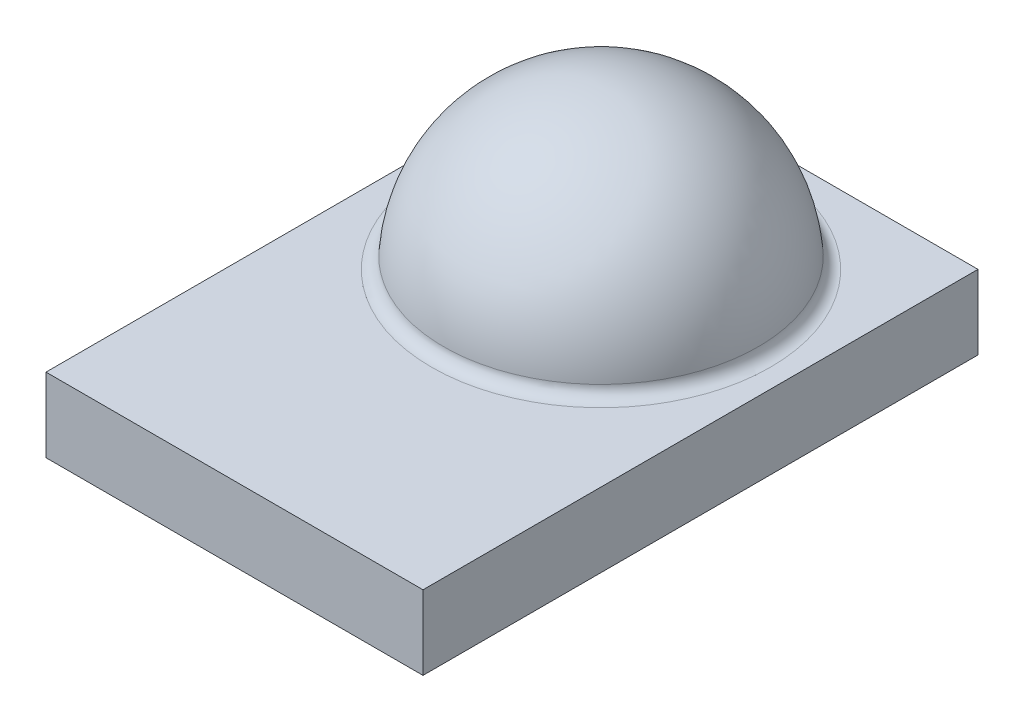
ISO-10303-21;
HEADER;
FILE_DESCRIPTION(('STEP AP214'),'2;1');
FILE_NAME('part.step','',(''),(''),'','','');
FILE_SCHEMA(('AUTOMOTIVE_DESIGN { 1 0 10303 214 1 1 1 1 }'));
ENDSEC;
DATA;
#1=APPLICATION_CONTEXT('core data for automotive mechanical design processes');
#2=APPLICATION_PROTOCOL_DEFINITION('international standard','automotive_design',2000,#1);
#3=PRODUCT_CONTEXT('',#1,'mechanical');
#4=PRODUCT('Part','Part','',(#3));
#5=PRODUCT_RELATED_PRODUCT_CATEGORY('part','',(#4));
#6=PRODUCT_DEFINITION_FORMATION('','',#4);
#7=PRODUCT_DEFINITION_CONTEXT('part definition',#1,'design');
#8=PRODUCT_DEFINITION('design','',#6,#7);
#9=PRODUCT_DEFINITION_SHAPE('','',#8);
#10=(LENGTH_UNIT() NAMED_UNIT(*) SI_UNIT(.MILLI.,.METRE.));
#11=(NAMED_UNIT(*) PLANE_ANGLE_UNIT() SI_UNIT($,.RADIAN.));
#12=(NAMED_UNIT(*) SI_UNIT($,.STERADIAN.) SOLID_ANGLE_UNIT());
#13=UNCERTAINTY_MEASURE_WITH_UNIT(LENGTH_MEASURE(1.E-05),#10,'distance_accuracy_value','');
#14=(GEOMETRIC_REPRESENTATION_CONTEXT(3) GLOBAL_UNCERTAINTY_ASSIGNED_CONTEXT((#13)) GLOBAL_UNIT_ASSIGNED_CONTEXT((#10,
#11,#12)) REPRESENTATION_CONTEXT('',''));
#15=CARTESIAN_POINT('',(0.,0.,0.));
#16=DIRECTION('',(0.,0.,1.));
#17=DIRECTION('',(1.,0.,0.));
#18=AXIS2_PLACEMENT_3D('',#15,#16,#17);
#19=CARTESIAN_POINT('',(0.,0.,0.));
#20=DIRECTION('',(0.,-1.,0.));
#21=DIRECTION('',(0.,0.,-1.));
#22=AXIS2_PLACEMENT_3D('',#19,#20,#21);
#23=PLANE('',#22);
#24=DIRECTION('',(0.,0.,1.));
#25=VECTOR('',#24,1.);
#26=CARTESIAN_POINT('',(0.,0.,0.));
#27=LINE('',#26,#25);
#28=CARTESIAN_POINT('',(0.,0.,-4.48999999999999));
#29=VERTEX_POINT('',#28);
#30=CARTESIAN_POINT('',(0.,0.,0.));
#31=VERTEX_POINT('',#30);
#32=EDGE_CURVE('E233',#29,#31,#27,.T.);
#33=ORIENTED_EDGE('',*,*,#32,.F.);
#34=DIRECTION('',(-1.,0.,0.));
#35=VECTOR('',#34,1.);
#36=CARTESIAN_POINT('',(0.,0.,-4.48999999999999));
#37=LINE('',#36,#35);
#38=CARTESIAN_POINT('',(3.05,0.,-4.48999999999999));
#39=VERTEX_POINT('',#38);
#40=EDGE_CURVE('E238',#39,#29,#37,.T.);
#41=ORIENTED_EDGE('',*,*,#40,.F.);
#42=DIRECTION('',(0.,0.,-1.));
#43=VECTOR('',#42,1.);
#44=CARTESIAN_POINT('',(3.05,0.,0.));
#45=LINE('',#44,#43);
#46=CARTESIAN_POINT('',(3.05,0.,0.));
#47=VERTEX_POINT('',#46);
#48=EDGE_CURVE('E249',#47,#39,#45,.T.);
#49=ORIENTED_EDGE('',*,*,#48,.F.);
#50=DIRECTION('',(1.,0.,0.));
#51=VECTOR('',#50,1.);
#52=CARTESIAN_POINT('',(0.,0.,0.));
#53=LINE('',#52,#51);
#54=EDGE_CURVE('E247',#31,#47,#53,.T.);
#55=ORIENTED_EDGE('',*,*,#54,.F.);
#56=EDGE_LOOP('',(#33,#41,#49,#55));
#57=FACE_BOUND('',#56,.T.);
#58=DIRECTION('',(1.,0.,0.));
#59=VECTOR('',#58,1.);
#60=CARTESIAN_POINT('',(0.124999999999997,0.,-4.36499999999999));
#61=LINE('',#60,#59);
#62=CARTESIAN_POINT('',(0.124999999999997,0.,-4.36499999999999));
#63=VERTEX_POINT('',#62);
#64=CARTESIAN_POINT('',(2.925,0.,-4.36499999999999));
#65=VERTEX_POINT('',#64);
#66=EDGE_CURVE('E218',#63,#65,#61,.T.);
#67=ORIENTED_EDGE('',*,*,#66,.F.);
#68=DIRECTION('',(0.,0.,-1.));
#69=VECTOR('',#68,1.);
#70=CARTESIAN_POINT('',(0.124999999999997,0.,-4.36499999999999));
#71=LINE('',#70,#69);
#72=CARTESIAN_POINT('',(0.124999999999997,0.,-2.59499999999999));
#73=VERTEX_POINT('',#72);
#74=EDGE_CURVE('E204',#73,#63,#71,.T.);
#75=ORIENTED_EDGE('',*,*,#74,.F.);
#76=DIRECTION('',(-1.,0.,0.));
#77=VECTOR('',#76,1.);
#78=CARTESIAN_POINT('',(0.124999999999997,0.,-2.59499999999999));
#79=LINE('',#78,#77);
#80=CARTESIAN_POINT('',(2.925,0.,-2.59499999999999));
#81=VERTEX_POINT('',#80);
#82=EDGE_CURVE('E209',#81,#73,#79,.T.);
#83=ORIENTED_EDGE('',*,*,#82,.F.);
#84=DIRECTION('',(0.,0.,1.));
#85=VECTOR('',#84,1.);
#86=CARTESIAN_POINT('',(2.925,0.,-4.36499999999999));
#87=LINE('',#86,#85);
#88=EDGE_CURVE('E220',#65,#81,#87,.T.);
#89=ORIENTED_EDGE('',*,*,#88,.F.);
#90=EDGE_LOOP('',(#67,#75,#83,#89));
#91=FACE_BOUND('',#90,.T.);
#92=DIRECTION('',(1.,0.,0.));
#93=VECTOR('',#92,1.);
#94=CARTESIAN_POINT('',(0.124999999999997,0.,-0.794999999999994));
#95=LINE('',#94,#93);
#96=CARTESIAN_POINT('',(0.124999999999997,0.,-0.794999999999994));
#97=VERTEX_POINT('',#96);
#98=CARTESIAN_POINT('',(1.325,0.,-0.794999999999994));
#99=VERTEX_POINT('',#98);
#100=EDGE_CURVE('E176',#97,#99,#95,.T.);
#101=ORIENTED_EDGE('',*,*,#100,.F.);
#102=DIRECTION('',(0.,0.,-1.));
#103=VECTOR('',#102,1.);
#104=CARTESIAN_POINT('',(0.124999999999997,0.,-0.124999999999994));
#105=LINE('',#104,#103);
#106=CARTESIAN_POINT('',(0.124999999999997,0.,-0.124999999999994));
#107=VERTEX_POINT('',#106);
#108=EDGE_CURVE('E173',#107,#97,#105,.T.);
#109=ORIENTED_EDGE('',*,*,#108,.F.);
#110=DIRECTION('',(-1.,0.,0.));
#111=VECTOR('',#110,1.);
#112=CARTESIAN_POINT('',(0.124999999999997,0.,-0.124999999999994));
#113=LINE('',#112,#111);
#114=CARTESIAN_POINT('',(1.325,0.,-0.124999999999994));
#115=VERTEX_POINT('',#114);
#116=EDGE_CURVE('E185',#115,#107,#113,.T.);
#117=ORIENTED_EDGE('',*,*,#116,.F.);
#118=DIRECTION('',(0.,0.,1.));
#119=VECTOR('',#118,1.);
#120=CARTESIAN_POINT('',(1.325,0.,-0.124999999999994));
#121=LINE('',#120,#119);
#122=EDGE_CURVE('E193',#99,#115,#121,.T.);
#123=ORIENTED_EDGE('',*,*,#122,.F.);
#124=EDGE_LOOP('',(#101,#109,#117,#123));
#125=FACE_BOUND('',#124,.T.);
#126=DIRECTION('',(1.,0.,0.));
#127=VECTOR('',#126,1.);
#128=CARTESIAN_POINT('',(1.725,0.,-0.794999999999994));
#129=LINE('',#128,#127);
#130=CARTESIAN_POINT('',(1.725,0.,-0.794999999999994));
#131=VERTEX_POINT('',#130);
#132=CARTESIAN_POINT('',(2.925,0.,-0.794999999999994));
#133=VERTEX_POINT('',#132);
#134=EDGE_CURVE('E481',#131,#133,#129,.T.);
#135=ORIENTED_EDGE('',*,*,#134,.F.);
#136=DIRECTION('',(0.,0.,-1.));
#137=VECTOR('',#136,1.);
#138=CARTESIAN_POINT('',(1.725,0.,-0.124999999999994));
#139=LINE('',#138,#137);
#140=CARTESIAN_POINT('',(1.725,0.,-0.124999999999994));
#141=VERTEX_POINT('',#140);
#142=EDGE_CURVE('E171',#141,#131,#139,.T.);
#143=ORIENTED_EDGE('',*,*,#142,.F.);
#144=DIRECTION('',(-1.,0.,0.));
#145=VECTOR('',#144,1.);
#146=CARTESIAN_POINT('',(1.725,0.,-0.124999999999994));
#147=LINE('',#146,#145);
#148=CARTESIAN_POINT('',(2.925,0.,-0.124999999999994));
#149=VERTEX_POINT('',#148);
#150=EDGE_CURVE('E167',#149,#141,#147,.T.);
#151=ORIENTED_EDGE('',*,*,#150,.F.);
#152=DIRECTION('',(0.,0.,1.));
#153=VECTOR('',#152,1.);
#154=CARTESIAN_POINT('',(2.925,0.,-0.124999999999994));
#155=LINE('',#154,#153);
#156=EDGE_CURVE('E478',#133,#149,#155,.T.);
#157=ORIENTED_EDGE('',*,*,#156,.F.);
#158=EDGE_LOOP('',(#135,#143,#151,#157));
#159=FACE_BOUND('',#158,.T.);
#160=ADVANCED_FACE('F34',(#57,#91,#125,#159),#23,.T.);
#161=CARTESIAN_POINT('',(0.,0.6,0.));
#162=DIRECTION('',(1.,0.,0.));
#163=DIRECTION('',(0.,0.,-1.));
#164=AXIS2_PLACEMENT_3D('',#161,#162,#163);
#165=PLANE('',#164);
#166=ORIENTED_EDGE('',*,*,#32,.T.);
#167=DIRECTION('',(0.,-1.,0.));
#168=VECTOR('',#167,1.);
#169=CARTESIAN_POINT('',(0.,0.6,0.));
#170=LINE('',#169,#168);
#171=CARTESIAN_POINT('',(0.,0.6,0.));
#172=VERTEX_POINT('',#171);
#173=EDGE_CURVE('E260',#172,#31,#170,.T.);
#174=ORIENTED_EDGE('',*,*,#173,.F.);
#175=DIRECTION('',(0.,0.,1.));
#176=VECTOR('',#175,1.);
#177=CARTESIAN_POINT('',(0.,0.6,0.));
#178=LINE('',#177,#176);
#179=CARTESIAN_POINT('',(0.,0.6,-4.48999999999999));
#180=VERTEX_POINT('',#179);
#181=EDGE_CURVE('E234',#180,#172,#178,.T.);
#182=ORIENTED_EDGE('',*,*,#181,.F.);
#183=DIRECTION('',(0.,-1.,0.));
#184=VECTOR('',#183,1.);
#185=CARTESIAN_POINT('',(0.,0.6,-4.48999999999999));
#186=LINE('',#185,#184);
#187=EDGE_CURVE('E244',#180,#29,#186,.T.);
#188=ORIENTED_EDGE('',*,*,#187,.T.);
#189=EDGE_LOOP('',(#166,#174,#182,#188));
#190=FACE_BOUND('',#189,.T.);
#191=ADVANCED_FACE('F281',(#190),#165,.F.);
#192=CARTESIAN_POINT('',(0.,0.6,0.));
#193=DIRECTION('',(0.,0.,-1.));
#194=DIRECTION('',(-1.,0.,0.));
#195=AXIS2_PLACEMENT_3D('',#192,#193,#194);
#196=PLANE('',#195);
#197=ORIENTED_EDGE('',*,*,#54,.T.);
#198=DIRECTION('',(0.,-1.,0.));
#199=VECTOR('',#198,1.);
#200=CARTESIAN_POINT('',(3.05,0.6,0.));
#201=LINE('',#200,#199);
#202=CARTESIAN_POINT('',(3.05,0.6,0.));
#203=VERTEX_POINT('',#202);
#204=EDGE_CURVE('E257',#203,#47,#201,.T.);
#205=ORIENTED_EDGE('',*,*,#204,.F.);
#206=DIRECTION('',(1.,0.,0.));
#207=VECTOR('',#206,1.);
#208=CARTESIAN_POINT('',(0.,0.6,0.));
#209=LINE('',#208,#207);
#210=EDGE_CURVE('E237',#172,#203,#209,.T.);
#211=ORIENTED_EDGE('',*,*,#210,.F.);
#212=ORIENTED_EDGE('',*,*,#173,.T.);
#213=EDGE_LOOP('',(#197,#205,#211,#212));
#214=FACE_BOUND('',#213,.T.);
#215=ADVANCED_FACE('F287',(#214),#196,.F.);
#216=CARTESIAN_POINT('',(3.05,0.6,0.));
#217=DIRECTION('',(-1.,0.,0.));
#218=DIRECTION('',(0.,0.,1.));
#219=AXIS2_PLACEMENT_3D('',#216,#217,#218);
#220=PLANE('',#219);
#221=ORIENTED_EDGE('',*,*,#48,.T.);
#222=DIRECTION('',(0.,-1.,0.));
#223=VECTOR('',#222,1.);
#224=CARTESIAN_POINT('',(3.05,0.6,-4.48999999999999));
#225=LINE('',#224,#223);
#226=CARTESIAN_POINT('',(3.05,0.6,-4.48999999999999));
#227=VERTEX_POINT('',#226);
#228=EDGE_CURVE('E254',#227,#39,#225,.T.);
#229=ORIENTED_EDGE('',*,*,#228,.F.);
#230=DIRECTION('',(0.,0.,-1.));
#231=VECTOR('',#230,1.);
#232=CARTESIAN_POINT('',(3.05,0.6,0.));
#233=LINE('',#232,#231);
#234=EDGE_CURVE('E240',#203,#227,#233,.T.);
#235=ORIENTED_EDGE('',*,*,#234,.F.);
#236=ORIENTED_EDGE('',*,*,#204,.T.);
#237=EDGE_LOOP('',(#221,#229,#235,#236));
#238=FACE_BOUND('',#237,.T.);
#239=ADVANCED_FACE('F296',(#238),#220,.F.);
#240=CARTESIAN_POINT('',(0.,0.6,-4.48999999999999));
#241=DIRECTION('',(0.,0.,1.));
#242=DIRECTION('',(1.,0.,0.));
#243=AXIS2_PLACEMENT_3D('',#240,#241,#242);
#244=PLANE('',#243);
#245=ORIENTED_EDGE('',*,*,#40,.T.);
#246=ORIENTED_EDGE('',*,*,#187,.F.);
#247=DIRECTION('',(-1.,0.,0.));
#248=VECTOR('',#247,1.);
#249=CARTESIAN_POINT('',(0.,0.6,-4.48999999999999));
#250=LINE('',#249,#248);
#251=EDGE_CURVE('E242',#227,#180,#250,.T.);
#252=ORIENTED_EDGE('',*,*,#251,.F.);
#253=ORIENTED_EDGE('',*,*,#228,.T.);
#254=EDGE_LOOP('',(#245,#246,#252,#253));
#255=FACE_BOUND('',#254,.T.);
#256=ADVANCED_FACE('F293',(#255),#244,.F.);
#257=CARTESIAN_POINT('',(0.,0.6,0.));
#258=DIRECTION('',(0.,-1.,0.));
#259=DIRECTION('',(0.,0.,-1.));
#260=AXIS2_PLACEMENT_3D('',#257,#258,#259);
#261=PLANE('',#260);
#262=CARTESIAN_POINT('',(1.525,0.6,-2.96499999999999));
#263=DIRECTION('',(0.,-1.,0.));
#264=DIRECTION('',(0.,0.,-1.));
#265=AXIS2_PLACEMENT_3D('',#262,#263,#264);
#266=CIRCLE('',#265,1.37135881519025);
#267=CARTESIAN_POINT('',(1.525,0.6,-4.33635881519024));
#268=VERTEX_POINT('',#267);
#269=EDGE_CURVE('E11',#268,#268,#266,.T.);
#270=ORIENTED_EDGE('',*,*,#269,.T.);
#271=EDGE_LOOP('',(#270));
#272=FACE_BOUND('',#271,.T.);
#273=ORIENTED_EDGE('',*,*,#181,.T.);
#274=ORIENTED_EDGE('',*,*,#210,.T.);
#275=ORIENTED_EDGE('',*,*,#234,.T.);
#276=ORIENTED_EDGE('',*,*,#251,.T.);
#277=EDGE_LOOP('',(#273,#274,#275,#276));
#278=FACE_BOUND('',#277,.T.);
#279=ADVANCED_FACE('F277',(#272,#278),#261,.F.);
#280=CARTESIAN_POINT('',(1.525,0.6,-2.96499999999999));
#281=DIRECTION('',(-1.,0.,0.));
#282=DIRECTION('',(0.,0.,1.));
#283=AXIS2_PLACEMENT_3D('',#280,#281,#282);
#284=SPHERICAL_SURFACE('',#283,1.275);
#285=CARTESIAN_POINT('',(1.525,0.6,-2.96499999999999));
#286=DIRECTION('',(0.,-1.,0.));
#287=DIRECTION('',(0.,0.,-1.));
#288=AXIS2_PLACEMENT_3D('',#285,#286,#287);
#289=SPHERICAL_SURFACE('',#288,1.275);
#290=CARTESIAN_POINT('',(1.525,0.692727272727273,-2.96499999999999));
#291=DIRECTION('',(0.,-1.,0.));
#292=DIRECTION('',(0.,0.,-1.));
#293=AXIS2_PLACEMENT_3D('',#290,#291,#292);
#294=CIRCLE('',#293,1.27162362863096);
#295=CARTESIAN_POINT('',(1.525,0.692727272727273,-4.23662362863095));
#296=VERTEX_POINT('',#295);
#297=EDGE_CURVE('E42',#296,#296,#294,.F.);
#298=ORIENTED_EDGE('',*,*,#297,.T.);
#299=EDGE_LOOP('',(#298));
#300=FACE_BOUND('',#299,.T.);
#301=ADVANCED_FACE('F265',(#300),#289,.T.);
#302=CARTESIAN_POINT('',(1.525,0.7,-2.96499999999999));
#303=DIRECTION('',(0.,-1.,0.));
#304=DIRECTION('',(0.,0.,-1.));
#305=AXIS2_PLACEMENT_3D('',#302,#303,#304);
#306=TOROIDAL_SURFACE('',#305,1.37135881519025,0.1);
#307=ORIENTED_EDGE('',*,*,#269,.F.);
#308=EDGE_LOOP('',(#307));
#309=FACE_BOUND('',#308,.T.);
#310=ORIENTED_EDGE('',*,*,#297,.F.);
#311=EDGE_LOOP('',(#310));
#312=FACE_BOUND('',#311,.T.);
#313=ADVANCED_FACE('F36',(#309,#312),#306,.F.);
#314=CARTESIAN_POINT('',(0.124999999999997,-0.08,-4.36499999999999));
#315=DIRECTION('',(1.,0.,0.));
#316=DIRECTION('',(0.,0.,-1.));
#317=AXIS2_PLACEMENT_3D('',#314,#315,#316);
#318=PLANE('',#317);
#319=ORIENTED_EDGE('',*,*,#74,.T.);
#320=DIRECTION('',(0.,1.,0.));
#321=VECTOR('',#320,1.);
#322=CARTESIAN_POINT('',(0.124999999999997,-0.08,-4.36499999999999));
#323=LINE('',#322,#321);
#324=CARTESIAN_POINT('',(0.124999999999997,-0.08,-4.36499999999999));
#325=VERTEX_POINT('',#324);
#326=EDGE_CURVE('E231',#325,#63,#323,.T.);
#327=ORIENTED_EDGE('',*,*,#326,.F.);
#328=DIRECTION('',(0.,0.,-1.));
#329=VECTOR('',#328,1.);
#330=CARTESIAN_POINT('',(0.124999999999997,-0.08,-4.36499999999999));
#331=LINE('',#330,#329);
#332=CARTESIAN_POINT('',(0.124999999999997,-0.08,-2.59499999999999));
#333=VERTEX_POINT('',#332);
#334=EDGE_CURVE('E205',#333,#325,#331,.T.);
#335=ORIENTED_EDGE('',*,*,#334,.F.);
#336=DIRECTION('',(0.,1.,0.));
#337=VECTOR('',#336,1.);
#338=CARTESIAN_POINT('',(0.124999999999997,-0.08,-2.59499999999999));
#339=LINE('',#338,#337);
#340=EDGE_CURVE('E215',#333,#73,#339,.T.);
#341=ORIENTED_EDGE('',*,*,#340,.T.);
#342=EDGE_LOOP('',(#319,#327,#335,#341));
#343=FACE_BOUND('',#342,.T.);
#344=ADVANCED_FACE('F268',(#343),#318,.F.);
#345=CARTESIAN_POINT('',(0.124999999999997,-0.08,-4.36499999999999));
#346=DIRECTION('',(0.,0.,1.));
#347=DIRECTION('',(1.,0.,0.));
#348=AXIS2_PLACEMENT_3D('',#345,#346,#347);
#349=PLANE('',#348);
#350=ORIENTED_EDGE('',*,*,#66,.T.);
#351=DIRECTION('',(0.,1.,0.));
#352=VECTOR('',#351,1.);
#353=CARTESIAN_POINT('',(2.925,-0.08,-4.36499999999999));
#354=LINE('',#353,#352);
#355=CARTESIAN_POINT('',(2.925,-0.08,-4.36499999999999));
#356=VERTEX_POINT('',#355);
#357=EDGE_CURVE('E228',#356,#65,#354,.T.);
#358=ORIENTED_EDGE('',*,*,#357,.F.);
#359=DIRECTION('',(1.,0.,0.));
#360=VECTOR('',#359,1.);
#361=CARTESIAN_POINT('',(0.124999999999997,-0.08,-4.36499999999999));
#362=LINE('',#361,#360);
#363=EDGE_CURVE('E208',#325,#356,#362,.T.);
#364=ORIENTED_EDGE('',*,*,#363,.F.);
#365=ORIENTED_EDGE('',*,*,#326,.T.);
#366=EDGE_LOOP('',(#350,#358,#364,#365));
#367=FACE_BOUND('',#366,.T.);
#368=ADVANCED_FACE('F274',(#367),#349,.F.);
#369=CARTESIAN_POINT('',(2.925,-0.08,-4.36499999999999));
#370=DIRECTION('',(-1.,0.,0.));
#371=DIRECTION('',(0.,0.,1.));
#372=AXIS2_PLACEMENT_3D('',#369,#370,#371);
#373=PLANE('',#372);
#374=ORIENTED_EDGE('',*,*,#88,.T.);
#375=DIRECTION('',(0.,1.,0.));
#376=VECTOR('',#375,1.);
#377=CARTESIAN_POINT('',(2.925,-0.08,-2.59499999999999));
#378=LINE('',#377,#376);
#379=CARTESIAN_POINT('',(2.925,-0.08,-2.59499999999999));
#380=VERTEX_POINT('',#379);
#381=EDGE_CURVE('E226',#380,#81,#378,.T.);
#382=ORIENTED_EDGE('',*,*,#381,.F.);
#383=DIRECTION('',(0.,0.,1.));
#384=VECTOR('',#383,1.);
#385=CARTESIAN_POINT('',(2.925,-0.08,-4.36499999999999));
#386=LINE('',#385,#384);
#387=EDGE_CURVE('E211',#356,#380,#386,.T.);
#388=ORIENTED_EDGE('',*,*,#387,.F.);
#389=ORIENTED_EDGE('',*,*,#357,.T.);
#390=EDGE_LOOP('',(#374,#382,#388,#389));
#391=FACE_BOUND('',#390,.T.);
#392=ADVANCED_FACE('F348',(#391),#373,.F.);
#393=CARTESIAN_POINT('',(0.124999999999997,-0.08,-2.59499999999999));
#394=DIRECTION('',(0.,0.,-1.));
#395=DIRECTION('',(-1.,0.,0.));
#396=AXIS2_PLACEMENT_3D('',#393,#394,#395);
#397=PLANE('',#396);
#398=ORIENTED_EDGE('',*,*,#82,.T.);
#399=ORIENTED_EDGE('',*,*,#340,.F.);
#400=DIRECTION('',(-1.,0.,0.));
#401=VECTOR('',#400,1.);
#402=CARTESIAN_POINT('',(0.124999999999997,-0.08,-2.59499999999999));
#403=LINE('',#402,#401);
#404=EDGE_CURVE('E213',#380,#333,#403,.T.);
#405=ORIENTED_EDGE('',*,*,#404,.F.);
#406=ORIENTED_EDGE('',*,*,#381,.T.);
#407=EDGE_LOOP('',(#398,#399,#405,#406));
#408=FACE_BOUND('',#407,.T.);
#409=ADVANCED_FACE('F358',(#408),#397,.F.);
#410=CARTESIAN_POINT('',(0.,-0.08,0.));
#411=DIRECTION('',(0.,1.,0.));
#412=DIRECTION('',(0.,0.,1.));
#413=AXIS2_PLACEMENT_3D('',#410,#411,#412);
#414=PLANE('',#413);
#415=ORIENTED_EDGE('',*,*,#334,.T.);
#416=ORIENTED_EDGE('',*,*,#363,.T.);
#417=ORIENTED_EDGE('',*,*,#387,.T.);
#418=ORIENTED_EDGE('',*,*,#404,.T.);
#419=EDGE_LOOP('',(#415,#416,#417,#418));
#420=FACE_BOUND('',#419,.T.);
#421=ADVANCED_FACE('F368',(#420),#414,.F.);
#422=CARTESIAN_POINT('',(0.124999999999997,-0.08,-0.124999999999994));
#423=DIRECTION('',(1.,0.,0.));
#424=DIRECTION('',(0.,0.,-1.));
#425=AXIS2_PLACEMENT_3D('',#422,#423,#424);
#426=PLANE('',#425);
#427=ORIENTED_EDGE('',*,*,#108,.T.);
#428=DIRECTION('',(0.,1.,0.));
#429=VECTOR('',#428,1.);
#430=CARTESIAN_POINT('',(0.124999999999997,-0.08,-0.794999999999994));
#431=LINE('',#430,#429);
#432=CARTESIAN_POINT('',(0.124999999999997,-0.08,-0.794999999999994));
#433=VERTEX_POINT('',#432);
#434=EDGE_CURVE('E202',#433,#97,#431,.T.);
#435=ORIENTED_EDGE('',*,*,#434,.F.);
#436=DIRECTION('',(0.,0.,-1.));
#437=VECTOR('',#436,1.);
#438=CARTESIAN_POINT('',(0.124999999999997,-0.08,-0.124999999999994));
#439=LINE('',#438,#437);
#440=CARTESIAN_POINT('',(0.124999999999997,-0.08,-0.124999999999994));
#441=VERTEX_POINT('',#440);
#442=EDGE_CURVE('E181',#441,#433,#439,.T.);
#443=ORIENTED_EDGE('',*,*,#442,.F.);
#444=DIRECTION('',(0.,1.,0.));
#445=VECTOR('',#444,1.);
#446=CARTESIAN_POINT('',(0.124999999999997,-0.08,-0.124999999999994));
#447=LINE('',#446,#445);
#448=EDGE_CURVE('E190',#441,#107,#447,.T.);
#449=ORIENTED_EDGE('',*,*,#448,.T.);
#450=EDGE_LOOP('',(#427,#435,#443,#449));
#451=FACE_BOUND('',#450,.T.);
#452=ADVANCED_FACE('F378',(#451),#426,.F.);
#453=CARTESIAN_POINT('',(0.124999999999997,-0.08,-0.794999999999994));
#454=DIRECTION('',(0.,0.,1.));
#455=DIRECTION('',(1.,0.,0.));
#456=AXIS2_PLACEMENT_3D('',#453,#454,#455);
#457=PLANE('',#456);
#458=ORIENTED_EDGE('',*,*,#100,.T.);
#459=DIRECTION('',(0.,1.,0.));
#460=VECTOR('',#459,1.);
#461=CARTESIAN_POINT('',(1.325,-0.08,-0.794999999999994));
#462=LINE('',#461,#460);
#463=CARTESIAN_POINT('',(1.325,-0.08,-0.794999999999994));
#464=VERTEX_POINT('',#463);
#465=EDGE_CURVE('E199',#464,#99,#462,.T.);
#466=ORIENTED_EDGE('',*,*,#465,.F.);
#467=DIRECTION('',(1.,0.,0.));
#468=VECTOR('',#467,1.);
#469=CARTESIAN_POINT('',(0.124999999999997,-0.08,-0.794999999999994));
#470=LINE('',#469,#468);
#471=EDGE_CURVE('E184',#433,#464,#470,.T.);
#472=ORIENTED_EDGE('',*,*,#471,.F.);
#473=ORIENTED_EDGE('',*,*,#434,.T.);
#474=EDGE_LOOP('',(#458,#466,#472,#473));
#475=FACE_BOUND('',#474,.T.);
#476=ADVANCED_FACE('F388',(#475),#457,.F.);
#477=CARTESIAN_POINT('',(1.325,-0.08,-0.124999999999994));
#478=DIRECTION('',(-1.,0.,0.));
#479=DIRECTION('',(0.,0.,1.));
#480=AXIS2_PLACEMENT_3D('',#477,#478,#479);
#481=PLANE('',#480);
#482=ORIENTED_EDGE('',*,*,#122,.T.);
#483=DIRECTION('',(0.,1.,0.));
#484=VECTOR('',#483,1.);
#485=CARTESIAN_POINT('',(1.325,-0.08,-0.124999999999994));
#486=LINE('',#485,#484);
#487=CARTESIAN_POINT('',(1.325,-0.08,-0.124999999999994));
#488=VERTEX_POINT('',#487);
#489=EDGE_CURVE('E57',#488,#115,#486,.T.);
#490=ORIENTED_EDGE('',*,*,#489,.F.);
#491=DIRECTION('',(0.,0.,1.));
#492=VECTOR('',#491,1.);
#493=CARTESIAN_POINT('',(1.325,-0.08,-0.124999999999994));
#494=LINE('',#493,#492);
#495=EDGE_CURVE('E187',#464,#488,#494,.T.);
#496=ORIENTED_EDGE('',*,*,#495,.F.);
#497=ORIENTED_EDGE('',*,*,#465,.T.);
#498=EDGE_LOOP('',(#482,#490,#496,#497));
#499=FACE_BOUND('',#498,.T.);
#500=ADVANCED_FACE('F398',(#499),#481,.F.);
#501=CARTESIAN_POINT('',(0.124999999999997,-0.08,-0.124999999999994));
#502=DIRECTION('',(0.,0.,-1.));
#503=DIRECTION('',(-1.,0.,0.));
#504=AXIS2_PLACEMENT_3D('',#501,#502,#503);
#505=PLANE('',#504);
#506=ORIENTED_EDGE('',*,*,#116,.T.);
#507=ORIENTED_EDGE('',*,*,#448,.F.);
#508=DIRECTION('',(-1.,0.,0.));
#509=VECTOR('',#508,1.);
#510=CARTESIAN_POINT('',(0.124999999999997,-0.08,-0.124999999999994));
#511=LINE('',#510,#509);
#512=EDGE_CURVE('E189',#488,#441,#511,.T.);
#513=ORIENTED_EDGE('',*,*,#512,.F.);
#514=ORIENTED_EDGE('',*,*,#489,.T.);
#515=EDGE_LOOP('',(#506,#507,#513,#514));
#516=FACE_BOUND('',#515,.T.);
#517=ADVANCED_FACE('F408',(#516),#505,.F.);
#518=CARTESIAN_POINT('',(0.,-0.08,0.));
#519=DIRECTION('',(0.,-1.,0.));
#520=DIRECTION('',(0.,0.,-1.));
#521=AXIS2_PLACEMENT_3D('',#518,#519,#520);
#522=PLANE('',#521);
#523=ORIENTED_EDGE('',*,*,#442,.T.);
#524=ORIENTED_EDGE('',*,*,#471,.T.);
#525=ORIENTED_EDGE('',*,*,#495,.T.);
#526=ORIENTED_EDGE('',*,*,#512,.T.);
#527=EDGE_LOOP('',(#523,#524,#525,#526));
#528=FACE_BOUND('',#527,.T.);
#529=ADVANCED_FACE('F418',(#528),#522,.T.);
#530=CARTESIAN_POINT('',(1.725,-0.08,-0.124999999999994));
#531=DIRECTION('',(1.,0.,0.));
#532=DIRECTION('',(0.,0.,-1.));
#533=AXIS2_PLACEMENT_3D('',#530,#531,#532);
#534=PLANE('',#533);
#535=ORIENTED_EDGE('',*,*,#142,.T.);
#536=DIRECTION('',(0.,1.,0.));
#537=VECTOR('',#536,1.);
#538=CARTESIAN_POINT('',(1.725,-0.08,-0.794999999999994));
#539=LINE('',#538,#537);
#540=CARTESIAN_POINT('',(1.725,-0.08,-0.794999999999994));
#541=VERTEX_POINT('',#540);
#542=EDGE_CURVE('E152',#541,#131,#539,.T.);
#543=ORIENTED_EDGE('',*,*,#542,.F.);
#544=DIRECTION('',(0.,0.,-1.));
#545=VECTOR('',#544,1.);
#546=CARTESIAN_POINT('',(1.725,-0.08,-0.124999999999994));
#547=LINE('',#546,#545);
#548=CARTESIAN_POINT('',(1.725,-0.08,-0.124999999999994));
#549=VERTEX_POINT('',#548);
#550=EDGE_CURVE('E159',#549,#541,#547,.T.);
#551=ORIENTED_EDGE('',*,*,#550,.F.);
#552=DIRECTION('',(0.,1.,0.));
#553=VECTOR('',#552,1.);
#554=CARTESIAN_POINT('',(1.725,-0.08,-0.124999999999994));
#555=LINE('',#554,#553);
#556=EDGE_CURVE('E475',#549,#141,#555,.T.);
#557=ORIENTED_EDGE('',*,*,#556,.T.);
#558=EDGE_LOOP('',(#535,#543,#551,#557));
#559=FACE_BOUND('',#558,.T.);
#560=ADVANCED_FACE('F169',(#559),#534,.F.);
#561=CARTESIAN_POINT('',(1.725,-0.08,-0.794999999999994));
#562=DIRECTION('',(0.,0.,1.));
#563=DIRECTION('',(1.,0.,0.));
#564=AXIS2_PLACEMENT_3D('',#561,#562,#563);
#565=PLANE('',#564);
#566=ORIENTED_EDGE('',*,*,#134,.T.);
#567=DIRECTION('',(0.,1.,0.));
#568=VECTOR('',#567,1.);
#569=CARTESIAN_POINT('',(2.925,-0.08,-0.794999999999994));
#570=LINE('',#569,#568);
#571=CARTESIAN_POINT('',(2.925,-0.08,-0.794999999999994));
#572=VERTEX_POINT('',#571);
#573=EDGE_CURVE('E155',#572,#133,#570,.T.);
#574=ORIENTED_EDGE('',*,*,#573,.F.);
#575=DIRECTION('',(1.,0.,0.));
#576=VECTOR('',#575,1.);
#577=CARTESIAN_POINT('',(1.725,-0.08,-0.794999999999994));
#578=LINE('',#577,#576);
#579=EDGE_CURVE('E148',#541,#572,#578,.T.);
#580=ORIENTED_EDGE('',*,*,#579,.F.);
#581=ORIENTED_EDGE('',*,*,#542,.T.);
#582=EDGE_LOOP('',(#566,#574,#580,#581));
#583=FACE_BOUND('',#582,.T.);
#584=ADVANCED_FACE('F150',(#583),#565,.F.);
#585=CARTESIAN_POINT('',(2.925,-0.08,-0.124999999999994));
#586=DIRECTION('',(-1.,0.,0.));
#587=DIRECTION('',(0.,0.,1.));
#588=AXIS2_PLACEMENT_3D('',#585,#586,#587);
#589=PLANE('',#588);
#590=ORIENTED_EDGE('',*,*,#156,.T.);
#591=DIRECTION('',(0.,1.,0.));
#592=VECTOR('',#591,1.);
#593=CARTESIAN_POINT('',(2.925,-0.08,-0.124999999999994));
#594=LINE('',#593,#592);
#595=CARTESIAN_POINT('',(2.925,-0.08,-0.124999999999994));
#596=VERTEX_POINT('',#595);
#597=EDGE_CURVE('E49',#596,#149,#594,.T.);
#598=ORIENTED_EDGE('',*,*,#597,.F.);
#599=DIRECTION('',(0.,0.,1.));
#600=VECTOR('',#599,1.);
#601=CARTESIAN_POINT('',(2.925,-0.08,-0.124999999999994));
#602=LINE('',#601,#600);
#603=EDGE_CURVE('E158',#572,#596,#602,.T.);
#604=ORIENTED_EDGE('',*,*,#603,.F.);
#605=ORIENTED_EDGE('',*,*,#573,.T.);
#606=EDGE_LOOP('',(#590,#598,#604,#605));
#607=FACE_BOUND('',#606,.T.);
#608=ADVANCED_FACE('F444',(#607),#589,.F.);
#609=CARTESIAN_POINT('',(1.725,-0.08,-0.124999999999994));
#610=DIRECTION('',(0.,0.,-1.));
#611=DIRECTION('',(-1.,0.,0.));
#612=AXIS2_PLACEMENT_3D('',#609,#610,#611);
#613=PLANE('',#612);
#614=ORIENTED_EDGE('',*,*,#150,.T.);
#615=ORIENTED_EDGE('',*,*,#556,.F.);
#616=DIRECTION('',(-1.,0.,0.));
#617=VECTOR('',#616,1.);
#618=CARTESIAN_POINT('',(1.725,-0.08,-0.124999999999994));
#619=LINE('',#618,#617);
#620=EDGE_CURVE('E163',#596,#549,#619,.T.);
#621=ORIENTED_EDGE('',*,*,#620,.F.);
#622=ORIENTED_EDGE('',*,*,#597,.T.);
#623=EDGE_LOOP('',(#614,#615,#621,#622));
#624=FACE_BOUND('',#623,.T.);
#625=ADVANCED_FACE('F453',(#624),#613,.F.);
#626=CARTESIAN_POINT('',(0.,-0.08,0.));
#627=DIRECTION('',(0.,-1.,0.));
#628=DIRECTION('',(0.,0.,-1.));
#629=AXIS2_PLACEMENT_3D('',#626,#627,#628);
#630=PLANE('',#629);
#631=ORIENTED_EDGE('',*,*,#550,.T.);
#632=ORIENTED_EDGE('',*,*,#579,.T.);
#633=ORIENTED_EDGE('',*,*,#603,.T.);
#634=ORIENTED_EDGE('',*,*,#620,.T.);
#635=EDGE_LOOP('',(#631,#632,#633,#634));
#636=FACE_BOUND('',#635,.T.);
#637=ADVANCED_FACE('F162',(#636),#630,.T.);
#638=CLOSED_SHELL('',(#160,#191,#215,#239,#256,#279,#301,#313,#344,#368,#392,#409,#421,#452,
#476,#500,#517,#529,#560,#584,#608,#625,#637));
#639=MANIFOLD_SOLID_BREP('B2',#638);
#640=ADVANCED_BREP_SHAPE_REPRESENTATION('',(#18,#639),#14);
#641=SHAPE_DEFINITION_REPRESENTATION(#9,#640);
ENDSEC;
END-ISO-10303-21;
